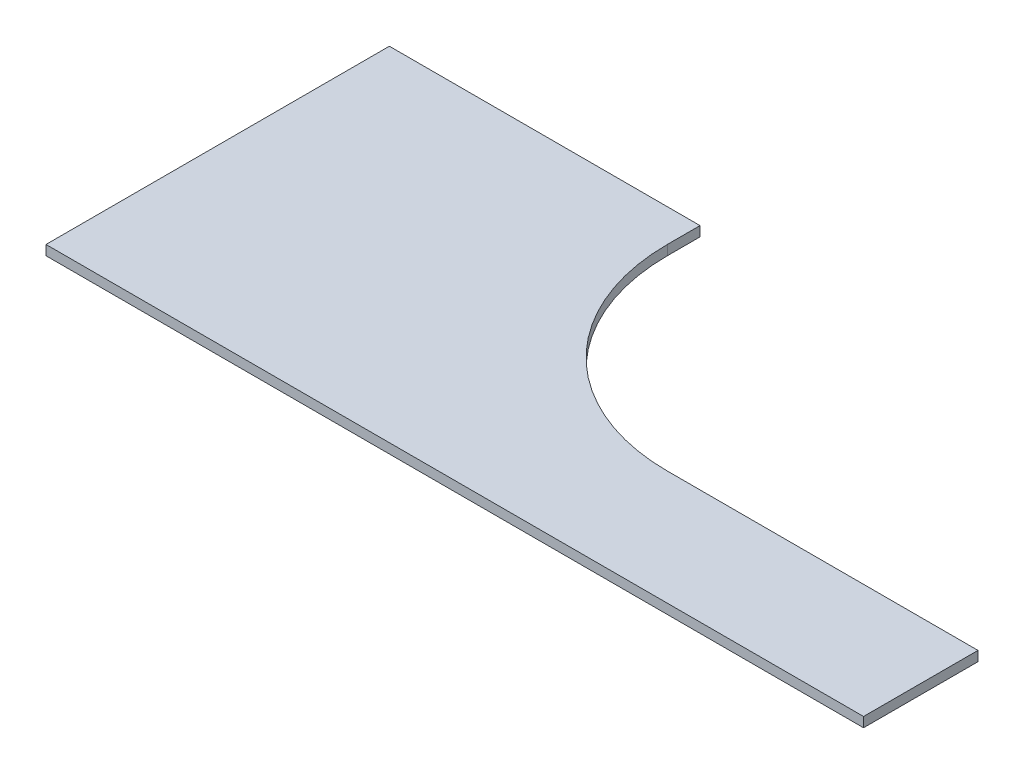
ISO-10303-21;
HEADER;
FILE_DESCRIPTION(('STEP AP214'),'2;1');
FILE_NAME('part.step','',(''),(''),'','','');
FILE_SCHEMA(('AUTOMOTIVE_DESIGN { 1 0 10303 214 1 1 1 1 }'));
ENDSEC;
DATA;
#1=APPLICATION_CONTEXT('core data for automotive mechanical design processes');
#2=APPLICATION_PROTOCOL_DEFINITION('international standard','automotive_design',2000,#1);
#3=PRODUCT_CONTEXT('',#1,'mechanical');
#4=PRODUCT('Part','Part','',(#3));
#5=PRODUCT_RELATED_PRODUCT_CATEGORY('part','',(#4));
#6=PRODUCT_DEFINITION_FORMATION('','',#4);
#7=PRODUCT_DEFINITION_CONTEXT('part definition',#1,'design');
#8=PRODUCT_DEFINITION('design','',#6,#7);
#9=PRODUCT_DEFINITION_SHAPE('','',#8);
#10=(LENGTH_UNIT() NAMED_UNIT(*) SI_UNIT(.MILLI.,.METRE.));
#11=(NAMED_UNIT(*) PLANE_ANGLE_UNIT() SI_UNIT($,.RADIAN.));
#12=(NAMED_UNIT(*) SI_UNIT($,.STERADIAN.) SOLID_ANGLE_UNIT());
#13=UNCERTAINTY_MEASURE_WITH_UNIT(LENGTH_MEASURE(1.E-05),#10,'distance_accuracy_value','');
#14=(GEOMETRIC_REPRESENTATION_CONTEXT(3) GLOBAL_UNCERTAINTY_ASSIGNED_CONTEXT((#13)) GLOBAL_UNIT_ASSIGNED_CONTEXT((#10,
#11,#12)) REPRESENTATION_CONTEXT('',''));
#15=CARTESIAN_POINT('',(0.,0.,0.));
#16=DIRECTION('',(0.,0.,1.));
#17=DIRECTION('',(1.,0.,0.));
#18=AXIS2_PLACEMENT_3D('',#15,#16,#17);
#19=CARTESIAN_POINT('',(78.6699389055989,-5.25,-42.7818403493442));
#20=DIRECTION('',(0.,1.,0.));
#21=DIRECTION('',(0.,0.,1.));
#22=AXIS2_PLACEMENT_3D('',#19,#20,#21);
#23=CYLINDRICAL_SURFACE('',#22,90.);
#24=CARTESIAN_POINT('',(78.6699389055989,-0.75,-42.7818403493442));
#25=DIRECTION('',(0.,-1.,0.));
#26=DIRECTION('',(0.,0.,-1.));
#27=AXIS2_PLACEMENT_3D('',#24,#25,#26);
#28=CIRCLE('',#27,90.);
#29=CARTESIAN_POINT('',(78.6699389055989,-0.75,47.2181596506558));
#30=VERTEX_POINT('',#29);
#31=CARTESIAN_POINT('',(-11.3300610944011,-0.75,-42.7818403493442));
#32=VERTEX_POINT('',#31);
#33=EDGE_CURVE('E126',#30,#32,#28,.T.);
#34=ORIENTED_EDGE('',*,*,#33,.F.);
#35=DIRECTION('',(0.,1.,0.));
#36=VECTOR('',#35,1.);
#37=CARTESIAN_POINT('',(78.6699389055989,-5.25,47.2181596506558));
#38=LINE('',#37,#36);
#39=CARTESIAN_POINT('',(78.6699389055989,-5.25,47.2181596506558));
#40=VERTEX_POINT('',#39);
#41=EDGE_CURVE('E11',#40,#30,#38,.T.);
#42=ORIENTED_EDGE('',*,*,#41,.F.);
#43=CARTESIAN_POINT('',(78.6699389055989,-5.25,-42.7818403493442));
#44=DIRECTION('',(0.,-1.,0.));
#45=DIRECTION('',(0.,0.,-1.));
#46=AXIS2_PLACEMENT_3D('',#43,#44,#45);
#47=CIRCLE('',#46,90.);
#48=CARTESIAN_POINT('',(-11.3300610944011,-5.25,-42.7818403493442));
#49=VERTEX_POINT('',#48);
#50=EDGE_CURVE('E143',#40,#49,#47,.T.);
#51=ORIENTED_EDGE('',*,*,#50,.T.);
#52=DIRECTION('',(0.,1.,0.));
#53=VECTOR('',#52,1.);
#54=CARTESIAN_POINT('',(-11.3300610944011,-5.25,-42.7818403493442));
#55=LINE('',#54,#53);
#56=EDGE_CURVE('E38',#49,#32,#55,.T.);
#57=ORIENTED_EDGE('',*,*,#56,.T.);
#58=EDGE_LOOP('',(#34,#42,#51,#57));
#59=FACE_BOUND('',#58,.T.);
#60=ADVANCED_FACE('F35',(#59),#23,.F.);
#61=CARTESIAN_POINT('',(221.169938905599,-5.25,47.2181596506558));
#62=DIRECTION('',(0.,0.,-1.));
#63=DIRECTION('',(-1.,0.,0.));
#64=AXIS2_PLACEMENT_3D('',#61,#62,#63);
#65=PLANE('',#64);
#66=DIRECTION('',(-1.,0.,0.));
#67=VECTOR('',#66,1.);
#68=CARTESIAN_POINT('',(221.169938905599,-0.75,47.2181596506558));
#69=LINE('',#68,#67);
#70=CARTESIAN_POINT('',(221.169938905599,-0.75,47.2181596506558));
#71=VERTEX_POINT('',#70);
#72=EDGE_CURVE('E141',#71,#30,#69,.T.);
#73=ORIENTED_EDGE('',*,*,#72,.F.);
#74=DIRECTION('',(0.,1.,0.));
#75=VECTOR('',#74,1.);
#76=CARTESIAN_POINT('',(221.169938905599,-5.25,47.2181596506558));
#77=LINE('',#76,#75);
#78=CARTESIAN_POINT('',(221.169938905599,-5.25,47.2181596506558));
#79=VERTEX_POINT('',#78);
#80=EDGE_CURVE('E44',#79,#71,#77,.T.);
#81=ORIENTED_EDGE('',*,*,#80,.F.);
#82=DIRECTION('',(-1.,0.,0.));
#83=VECTOR('',#82,1.);
#84=CARTESIAN_POINT('',(221.169938905599,-5.25,47.2181596506558));
#85=LINE('',#84,#83);
#86=EDGE_CURVE('E116',#79,#40,#85,.T.);
#87=ORIENTED_EDGE('',*,*,#86,.T.);
#88=ORIENTED_EDGE('',*,*,#41,.T.);
#89=EDGE_LOOP('',(#73,#81,#87,#88));
#90=FACE_BOUND('',#89,.T.);
#91=ADVANCED_FACE('F153',(#90),#65,.T.);
#92=CARTESIAN_POINT('',(221.169938905599,-5.25,99.7181596506558));
#93=DIRECTION('',(1.,0.,0.));
#94=DIRECTION('',(0.,0.,-1.));
#95=AXIS2_PLACEMENT_3D('',#92,#93,#94);
#96=PLANE('',#95);
#97=DIRECTION('',(0.,0.,-1.));
#98=VECTOR('',#97,1.);
#99=CARTESIAN_POINT('',(221.169938905599,-0.75,99.7181596506558));
#100=LINE('',#99,#98);
#101=CARTESIAN_POINT('',(221.169938905599,-0.75,99.7181596506558));
#102=VERTEX_POINT('',#101);
#103=EDGE_CURVE('E103',#102,#71,#100,.T.);
#104=ORIENTED_EDGE('',*,*,#103,.F.);
#105=DIRECTION('',(0.,1.,0.));
#106=VECTOR('',#105,1.);
#107=CARTESIAN_POINT('',(221.169938905599,-5.25,99.7181596506558));
#108=LINE('',#107,#106);
#109=CARTESIAN_POINT('',(221.169938905599,-5.25,99.7181596506558));
#110=VERTEX_POINT('',#109);
#111=EDGE_CURVE('E98',#110,#102,#108,.T.);
#112=ORIENTED_EDGE('',*,*,#111,.F.);
#113=DIRECTION('',(0.,0.,-1.));
#114=VECTOR('',#113,1.);
#115=CARTESIAN_POINT('',(221.169938905599,-5.25,99.7181596506558));
#116=LINE('',#115,#114);
#117=EDGE_CURVE('E101',#110,#79,#116,.T.);
#118=ORIENTED_EDGE('',*,*,#117,.T.);
#119=ORIENTED_EDGE('',*,*,#80,.T.);
#120=EDGE_LOOP('',(#104,#112,#118,#119));
#121=FACE_BOUND('',#120,.T.);
#122=ADVANCED_FACE('F100',(#121),#96,.T.);
#123=CARTESIAN_POINT('',(-153.830061094401,-5.25,99.7181596506558));
#124=DIRECTION('',(0.,0.,1.));
#125=DIRECTION('',(1.,0.,0.));
#126=AXIS2_PLACEMENT_3D('',#123,#124,#125);
#127=PLANE('',#126);
#128=DIRECTION('',(1.,0.,0.));
#129=VECTOR('',#128,1.);
#130=CARTESIAN_POINT('',(-153.830061094401,-0.75,99.7181596506558));
#131=LINE('',#130,#129);
#132=CARTESIAN_POINT('',(-153.830061094401,-0.75,99.7181596506558));
#133=VERTEX_POINT('',#132);
#134=EDGE_CURVE('E138',#133,#102,#131,.T.);
#135=ORIENTED_EDGE('',*,*,#134,.F.);
#136=DIRECTION('',(0.,1.,0.));
#137=VECTOR('',#136,1.);
#138=CARTESIAN_POINT('',(-153.830061094401,-5.25,99.7181596506558));
#139=LINE('',#138,#137);
#140=CARTESIAN_POINT('',(-153.830061094401,-5.25,99.7181596506558));
#141=VERTEX_POINT('',#140);
#142=EDGE_CURVE('E108',#141,#133,#139,.T.);
#143=ORIENTED_EDGE('',*,*,#142,.F.);
#144=DIRECTION('',(1.,0.,0.));
#145=VECTOR('',#144,1.);
#146=CARTESIAN_POINT('',(-153.830061094401,-5.25,99.7181596506558));
#147=LINE('',#146,#145);
#148=EDGE_CURVE('E114',#141,#110,#147,.T.);
#149=ORIENTED_EDGE('',*,*,#148,.T.);
#150=ORIENTED_EDGE('',*,*,#111,.T.);
#151=EDGE_LOOP('',(#135,#143,#149,#150));
#152=FACE_BOUND('',#151,.T.);
#153=ADVANCED_FACE('F118',(#152),#127,.T.);
#154=CARTESIAN_POINT('',(-153.830061094401,-5.25,-57.7818403493441));
#155=DIRECTION('',(-1.,0.,0.));
#156=DIRECTION('',(0.,0.,1.));
#157=AXIS2_PLACEMENT_3D('',#154,#155,#156);
#158=PLANE('',#157);
#159=DIRECTION('',(0.,0.,1.));
#160=VECTOR('',#159,1.);
#161=CARTESIAN_POINT('',(-153.830061094401,-0.75,-57.7818403493441));
#162=LINE('',#161,#160);
#163=CARTESIAN_POINT('',(-153.830061094401,-0.75,-57.7818403493441));
#164=VERTEX_POINT('',#163);
#165=EDGE_CURVE('E135',#164,#133,#162,.T.);
#166=ORIENTED_EDGE('',*,*,#165,.F.);
#167=DIRECTION('',(0.,1.,0.));
#168=VECTOR('',#167,1.);
#169=CARTESIAN_POINT('',(-153.830061094401,-5.25,-57.7818403493441));
#170=LINE('',#169,#168);
#171=CARTESIAN_POINT('',(-153.830061094401,-5.25,-57.7818403493441));
#172=VERTEX_POINT('',#171);
#173=EDGE_CURVE('E147',#172,#164,#170,.T.);
#174=ORIENTED_EDGE('',*,*,#173,.F.);
#175=DIRECTION('',(0.,0.,1.));
#176=VECTOR('',#175,1.);
#177=CARTESIAN_POINT('',(-153.830061094401,-5.25,-57.7818403493441));
#178=LINE('',#177,#176);
#179=EDGE_CURVE('E119',#172,#141,#178,.T.);
#180=ORIENTED_EDGE('',*,*,#179,.T.);
#181=ORIENTED_EDGE('',*,*,#142,.T.);
#182=EDGE_LOOP('',(#166,#174,#180,#181));
#183=FACE_BOUND('',#182,.T.);
#184=ADVANCED_FACE('F166',(#183),#158,.T.);
#185=CARTESIAN_POINT('',(-11.3300610944011,-5.25,-57.7818403493441));
#186=DIRECTION('',(0.,0.,-1.));
#187=DIRECTION('',(-1.,0.,0.));
#188=AXIS2_PLACEMENT_3D('',#185,#186,#187);
#189=PLANE('',#188);
#190=DIRECTION('',(-1.,0.,0.));
#191=VECTOR('',#190,1.);
#192=CARTESIAN_POINT('',(-11.3300610944011,-0.75,-57.7818403493441));
#193=LINE('',#192,#191);
#194=CARTESIAN_POINT('',(-11.3300610944011,-0.75,-57.7818403493441));
#195=VERTEX_POINT('',#194);
#196=EDGE_CURVE('E132',#195,#164,#193,.T.);
#197=ORIENTED_EDGE('',*,*,#196,.F.);
#198=DIRECTION('',(0.,1.,0.));
#199=VECTOR('',#198,1.);
#200=CARTESIAN_POINT('',(-11.3300610944011,-5.25,-57.7818403493441));
#201=LINE('',#200,#199);
#202=CARTESIAN_POINT('',(-11.3300610944011,-5.25,-57.7818403493441));
#203=VERTEX_POINT('',#202);
#204=EDGE_CURVE('E148',#203,#195,#201,.T.);
#205=ORIENTED_EDGE('',*,*,#204,.F.);
#206=DIRECTION('',(-1.,0.,0.));
#207=VECTOR('',#206,1.);
#208=CARTESIAN_POINT('',(-11.3300610944011,-5.25,-57.7818403493441));
#209=LINE('',#208,#207);
#210=EDGE_CURVE('E121',#203,#172,#209,.T.);
#211=ORIENTED_EDGE('',*,*,#210,.T.);
#212=ORIENTED_EDGE('',*,*,#173,.T.);
#213=EDGE_LOOP('',(#197,#205,#211,#212));
#214=FACE_BOUND('',#213,.T.);
#215=ADVANCED_FACE('F169',(#214),#189,.T.);
#216=CARTESIAN_POINT('',(-11.3300610944011,-5.25,-42.7818403493442));
#217=DIRECTION('',(1.,0.,0.));
#218=DIRECTION('',(0.,0.,-1.));
#219=AXIS2_PLACEMENT_3D('',#216,#217,#218);
#220=PLANE('',#219);
#221=DIRECTION('',(0.,0.,-1.));
#222=VECTOR('',#221,1.);
#223=CARTESIAN_POINT('',(-11.3300610944011,-0.75,-42.7818403493442));
#224=LINE('',#223,#222);
#225=EDGE_CURVE('E129',#32,#195,#224,.T.);
#226=ORIENTED_EDGE('',*,*,#225,.F.);
#227=ORIENTED_EDGE('',*,*,#56,.F.);
#228=DIRECTION('',(0.,0.,-1.));
#229=VECTOR('',#228,1.);
#230=CARTESIAN_POINT('',(-11.3300610944011,-5.25,-42.7818403493442));
#231=LINE('',#230,#229);
#232=EDGE_CURVE('E231',#49,#203,#231,.T.);
#233=ORIENTED_EDGE('',*,*,#232,.T.);
#234=ORIENTED_EDGE('',*,*,#204,.T.);
#235=EDGE_LOOP('',(#226,#227,#233,#234));
#236=FACE_BOUND('',#235,.T.);
#237=ADVANCED_FACE('F150',(#236),#220,.T.);
#238=CARTESIAN_POINT('',(78.6699389055989,-5.25,-42.7818403493442));
#239=DIRECTION('',(0.,-1.,0.));
#240=DIRECTION('',(0.,0.,-1.));
#241=AXIS2_PLACEMENT_3D('',#238,#239,#240);
#242=PLANE('',#241);
#243=ORIENTED_EDGE('',*,*,#50,.F.);
#244=ORIENTED_EDGE('',*,*,#86,.F.);
#245=ORIENTED_EDGE('',*,*,#117,.F.);
#246=ORIENTED_EDGE('',*,*,#148,.F.);
#247=ORIENTED_EDGE('',*,*,#179,.F.);
#248=ORIENTED_EDGE('',*,*,#210,.F.);
#249=ORIENTED_EDGE('',*,*,#232,.F.);
#250=EDGE_LOOP('',(#243,#244,#245,#246,#247,#248,#249));
#251=FACE_BOUND('',#250,.T.);
#252=ADVANCED_FACE('F112',(#251),#242,.T.);
#253=CARTESIAN_POINT('',(78.6699389055989,-0.75,-42.7818403493442));
#254=DIRECTION('',(0.,-1.,0.));
#255=DIRECTION('',(0.,0.,-1.));
#256=AXIS2_PLACEMENT_3D('',#253,#254,#255);
#257=PLANE('',#256);
#258=ORIENTED_EDGE('',*,*,#33,.T.);
#259=ORIENTED_EDGE('',*,*,#225,.T.);
#260=ORIENTED_EDGE('',*,*,#196,.T.);
#261=ORIENTED_EDGE('',*,*,#165,.T.);
#262=ORIENTED_EDGE('',*,*,#134,.T.);
#263=ORIENTED_EDGE('',*,*,#103,.T.);
#264=ORIENTED_EDGE('',*,*,#72,.T.);
#265=EDGE_LOOP('',(#258,#259,#260,#261,#262,#263,#264));
#266=FACE_BOUND('',#265,.T.);
#267=ADVANCED_FACE('F152',(#266),#257,.F.);
#268=CLOSED_SHELL('',(#60,#91,#122,#153,#184,#215,#237,#252,#267));
#269=MANIFOLD_SOLID_BREP('B2',#268);
#270=ADVANCED_BREP_SHAPE_REPRESENTATION('',(#18,#269),#14);
#271=SHAPE_DEFINITION_REPRESENTATION(#9,#270);
ENDSEC;
END-ISO-10303-21;
